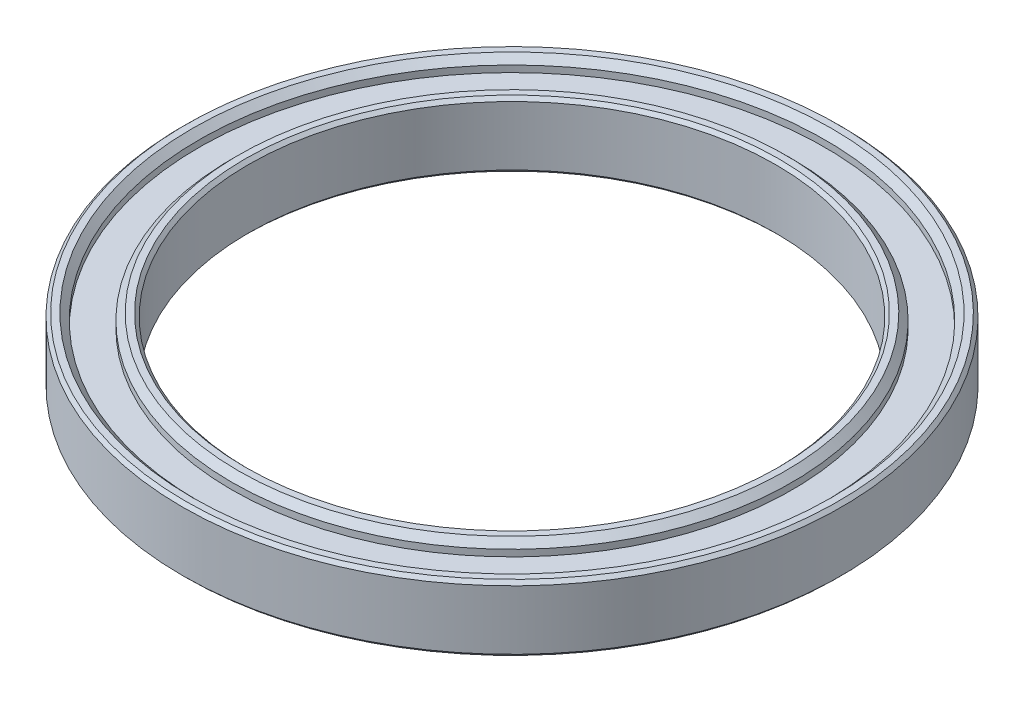
ISO-10303-21;
HEADER;
FILE_DESCRIPTION(('STEP AP214'),'2;1');
FILE_NAME('part.step','',(''),(''),'','','');
FILE_SCHEMA(('AUTOMOTIVE_DESIGN { 1 0 10303 214 1 1 1 1 }'));
ENDSEC;
DATA;
#1=APPLICATION_CONTEXT('core data for automotive mechanical design processes');
#2=APPLICATION_PROTOCOL_DEFINITION('international standard','automotive_design',2000,#1);
#3=PRODUCT_CONTEXT('',#1,'mechanical');
#4=PRODUCT('Part','Part','',(#3));
#5=PRODUCT_RELATED_PRODUCT_CATEGORY('part','',(#4));
#6=PRODUCT_DEFINITION_FORMATION('','',#4);
#7=PRODUCT_DEFINITION_CONTEXT('part definition',#1,'design');
#8=PRODUCT_DEFINITION('design','',#6,#7);
#9=PRODUCT_DEFINITION_SHAPE('','',#8);
#10=(LENGTH_UNIT() NAMED_UNIT(*) SI_UNIT(.MILLI.,.METRE.));
#11=(NAMED_UNIT(*) PLANE_ANGLE_UNIT() SI_UNIT($,.RADIAN.));
#12=(NAMED_UNIT(*) SI_UNIT($,.STERADIAN.) SOLID_ANGLE_UNIT());
#13=UNCERTAINTY_MEASURE_WITH_UNIT(LENGTH_MEASURE(1.E-05),#10,'distance_accuracy_value','');
#14=(GEOMETRIC_REPRESENTATION_CONTEXT(3) GLOBAL_UNCERTAINTY_ASSIGNED_CONTEXT((#13)) GLOBAL_UNIT_ASSIGNED_CONTEXT((#10,
#11,#12)) REPRESENTATION_CONTEXT('',''));
#15=CARTESIAN_POINT('',(0.,0.,0.));
#16=DIRECTION('',(0.,0.,1.));
#17=DIRECTION('',(1.,0.,0.));
#18=AXIS2_PLACEMENT_3D('',#15,#16,#17);
#19=CARTESIAN_POINT('',(0.,0.,0.));
#20=DIRECTION('',(0.,1.,0.));
#21=DIRECTION('',(0.,0.,1.));
#22=AXIS2_PLACEMENT_3D('',#19,#20,#21);
#23=PLANE('',#22);
#24=CARTESIAN_POINT('',(0.,0.,0.));
#25=DIRECTION('',(0.,1.,0.));
#26=DIRECTION('',(0.,0.,1.));
#27=AXIS2_PLACEMENT_3D('',#24,#25,#26);
#28=CIRCLE('',#27,41.5);
#29=CARTESIAN_POINT('',(0.,0.,41.5));
#30=VERTEX_POINT('',#29);
#31=EDGE_CURVE('E59',#30,#30,#28,.F.);
#32=ORIENTED_EDGE('',*,*,#31,.T.);
#33=EDGE_LOOP('',(#32));
#34=FACE_BOUND('',#33,.T.);
#35=CARTESIAN_POINT('',(0.,0.,0.));
#36=DIRECTION('',(0.,1.,0.));
#37=DIRECTION('',(0.,0.,1.));
#38=AXIS2_PLACEMENT_3D('',#35,#36,#37);
#39=CIRCLE('',#38,40.5);
#40=CARTESIAN_POINT('',(0.,0.,40.5));
#41=VERTEX_POINT('',#40);
#42=EDGE_CURVE('E94',#41,#41,#39,.T.);
#43=ORIENTED_EDGE('',*,*,#42,.T.);
#44=EDGE_LOOP('',(#43));
#45=FACE_BOUND('',#44,.T.);
#46=ADVANCED_FACE('F43',(#34,#45),#23,.F.);
#47=CARTESIAN_POINT('',(0.,10.,0.));
#48=DIRECTION('',(0.,1.,0.));
#49=DIRECTION('',(0.,0.,1.));
#50=AXIS2_PLACEMENT_3D('',#47,#48,#49);
#51=PLANE('',#50);
#52=CARTESIAN_POINT('',(0.,10.,0.));
#53=DIRECTION('',(0.,1.,0.));
#54=DIRECTION('',(0.,0.,1.));
#55=AXIS2_PLACEMENT_3D('',#52,#53,#54);
#56=CIRCLE('',#55,41.5);
#57=CARTESIAN_POINT('',(0.,10.,41.5));
#58=VERTEX_POINT('',#57);
#59=EDGE_CURVE('E67',#58,#58,#56,.T.);
#60=ORIENTED_EDGE('',*,*,#59,.T.);
#61=EDGE_LOOP('',(#60));
#62=FACE_BOUND('',#61,.T.);
#63=CARTESIAN_POINT('',(0.,10.,0.));
#64=DIRECTION('',(0.,1.,0.));
#65=DIRECTION('',(0.,0.,1.));
#66=AXIS2_PLACEMENT_3D('',#63,#64,#65);
#67=CIRCLE('',#66,40.5);
#68=CARTESIAN_POINT('',(0.,10.,40.5));
#69=VERTEX_POINT('',#68);
#70=EDGE_CURVE('E79',#69,#69,#67,.F.);
#71=ORIENTED_EDGE('',*,*,#70,.T.);
#72=EDGE_LOOP('',(#71));
#73=FACE_BOUND('',#72,.T.);
#74=ADVANCED_FACE('F133',(#62,#73),#51,.T.);
#75=CARTESIAN_POINT('',(0.,10.,0.));
#76=DIRECTION('',(0.,1.,0.));
#77=DIRECTION('',(0.,0.,1.));
#78=AXIS2_PLACEMENT_3D('',#75,#76,#77);
#79=CIRCLE('',#78,48.5);
#80=CARTESIAN_POINT('',(0.,10.,48.5));
#81=VERTEX_POINT('',#80);
#82=EDGE_CURVE('E70',#81,#81,#79,.F.);
#83=ORIENTED_EDGE('',*,*,#82,.T.);
#84=EDGE_LOOP('',(#83));
#85=FACE_BOUND('',#84,.T.);
#86=CARTESIAN_POINT('',(0.,10.,0.));
#87=DIRECTION('',(0.,1.,0.));
#88=DIRECTION('',(0.,0.,1.));
#89=AXIS2_PLACEMENT_3D('',#86,#87,#88);
#90=CIRCLE('',#89,49.5);
#91=CARTESIAN_POINT('',(0.,10.,49.5));
#92=VERTEX_POINT('',#91);
#93=EDGE_CURVE('E76',#92,#92,#90,.T.);
#94=ORIENTED_EDGE('',*,*,#93,.T.);
#95=EDGE_LOOP('',(#94));
#96=FACE_BOUND('',#95,.T.);
#97=ADVANCED_FACE('F140',(#85,#96),#51,.T.);
#98=CARTESIAN_POINT('',(0.,0.,0.));
#99=DIRECTION('',(0.,1.,0.));
#100=DIRECTION('',(0.,0.,1.));
#101=AXIS2_PLACEMENT_3D('',#98,#99,#100);
#102=CIRCLE('',#101,48.5);
#103=CARTESIAN_POINT('',(0.,0.,48.5));
#104=VERTEX_POINT('',#103);
#105=EDGE_CURVE('E10',#104,#104,#102,.T.);
#106=ORIENTED_EDGE('',*,*,#105,.T.);
#107=EDGE_LOOP('',(#106));
#108=FACE_BOUND('',#107,.T.);
#109=CARTESIAN_POINT('',(0.,0.,0.));
#110=DIRECTION('',(0.,1.,0.));
#111=DIRECTION('',(0.,0.,1.));
#112=AXIS2_PLACEMENT_3D('',#109,#110,#111);
#113=CIRCLE('',#112,49.5);
#114=CARTESIAN_POINT('',(0.,0.,49.5));
#115=VERTEX_POINT('',#114);
#116=EDGE_CURVE('E97',#115,#115,#113,.F.);
#117=ORIENTED_EDGE('',*,*,#116,.T.);
#118=EDGE_LOOP('',(#117));
#119=FACE_BOUND('',#118,.T.);
#120=ADVANCED_FACE('F136',(#108,#119),#23,.F.);
#121=CARTESIAN_POINT('',(0.,10.,0.));
#122=DIRECTION('',(0.,-1.,0.));
#123=DIRECTION('',(0.,0.,-1.));
#124=AXIS2_PLACEMENT_3D('',#121,#122,#123);
#125=CYLINDRICAL_SURFACE('',#124,50.);
#126=CARTESIAN_POINT('',(0.,0.499999999999994,0.));
#127=DIRECTION('',(0.,1.,0.));
#128=DIRECTION('',(0.,0.,1.));
#129=AXIS2_PLACEMENT_3D('',#126,#127,#128);
#130=CIRCLE('',#129,50.);
#131=CARTESIAN_POINT('',(0.,0.499999999999994,50.));
#132=VERTEX_POINT('',#131);
#133=EDGE_CURVE('E82',#132,#132,#130,.T.);
#134=ORIENTED_EDGE('',*,*,#133,.T.);
#135=EDGE_LOOP('',(#134));
#136=FACE_BOUND('',#135,.T.);
#137=CARTESIAN_POINT('',(0.,9.50000000000002,0.));
#138=DIRECTION('',(0.,1.,0.));
#139=DIRECTION('',(0.,0.,1.));
#140=AXIS2_PLACEMENT_3D('',#137,#138,#139);
#141=CIRCLE('',#140,50.);
#142=CARTESIAN_POINT('',(0.,9.50000000000002,50.));
#143=VERTEX_POINT('',#142);
#144=EDGE_CURVE('E85',#143,#143,#141,.F.);
#145=ORIENTED_EDGE('',*,*,#144,.T.);
#146=EDGE_LOOP('',(#145));
#147=FACE_BOUND('',#146,.T.);
#148=ADVANCED_FACE('F146',(#136,#147),#125,.T.);
#149=CARTESIAN_POINT('',(0.,10.,0.));
#150=DIRECTION('',(0.,-1.,0.));
#151=DIRECTION('',(0.,0.,-1.));
#152=AXIS2_PLACEMENT_3D('',#149,#150,#151);
#153=CYLINDRICAL_SURFACE('',#152,40.);
#154=CARTESIAN_POINT('',(0.,0.5,0.));
#155=DIRECTION('',(0.,1.,0.));
#156=DIRECTION('',(0.,0.,1.));
#157=AXIS2_PLACEMENT_3D('',#154,#155,#156);
#158=CIRCLE('',#157,40.);
#159=CARTESIAN_POINT('',(0.,0.5,40.));
#160=VERTEX_POINT('',#159);
#161=EDGE_CURVE('E88',#160,#160,#158,.F.);
#162=ORIENTED_EDGE('',*,*,#161,.T.);
#163=EDGE_LOOP('',(#162));
#164=FACE_BOUND('',#163,.T.);
#165=CARTESIAN_POINT('',(0.,9.49999999999996,0.));
#166=DIRECTION('',(0.,1.,0.));
#167=DIRECTION('',(0.,0.,1.));
#168=AXIS2_PLACEMENT_3D('',#165,#166,#167);
#169=CIRCLE('',#168,40.);
#170=CARTESIAN_POINT('',(0.,9.49999999999996,40.));
#171=VERTEX_POINT('',#170);
#172=EDGE_CURVE('E91',#171,#171,#169,.T.);
#173=ORIENTED_EDGE('',*,*,#172,.T.);
#174=EDGE_LOOP('',(#173));
#175=FACE_BOUND('',#174,.T.);
#176=ADVANCED_FACE('F151',(#164,#175),#153,.F.);
#177=CARTESIAN_POINT('',(0.,0.,0.));
#178=DIRECTION('',(0.,-1.,0.));
#179=DIRECTION('',(0.,0.,-1.));
#180=AXIS2_PLACEMENT_3D('',#177,#178,#179);
#181=CONICAL_SURFACE('',#180,40.5,0.785398163397448);
#182=ORIENTED_EDGE('',*,*,#161,.F.);
#183=EDGE_LOOP('',(#182));
#184=FACE_BOUND('',#183,.T.);
#185=ORIENTED_EDGE('',*,*,#42,.F.);
#186=EDGE_LOOP('',(#185));
#187=FACE_BOUND('',#186,.T.);
#188=ADVANCED_FACE('F161',(#184,#187),#181,.F.);
#189=CARTESIAN_POINT('',(0.,0.499999999999994,0.));
#190=DIRECTION('',(0.,1.,0.));
#191=DIRECTION('',(0.,0.,1.));
#192=AXIS2_PLACEMENT_3D('',#189,#190,#191);
#193=CONICAL_SURFACE('',#192,50.,0.785398163397448);
#194=ORIENTED_EDGE('',*,*,#116,.F.);
#195=EDGE_LOOP('',(#194));
#196=FACE_BOUND('',#195,.T.);
#197=ORIENTED_EDGE('',*,*,#133,.F.);
#198=EDGE_LOOP('',(#197));
#199=FACE_BOUND('',#198,.T.);
#200=ADVANCED_FACE('F157',(#196,#199),#193,.T.);
#201=CARTESIAN_POINT('',(0.,10.,0.));
#202=DIRECTION('',(0.,-1.,0.));
#203=DIRECTION('',(0.,0.,-1.));
#204=AXIS2_PLACEMENT_3D('',#201,#202,#203);
#205=CONICAL_SURFACE('',#204,49.5,0.785398163397469);
#206=ORIENTED_EDGE('',*,*,#144,.F.);
#207=EDGE_LOOP('',(#206));
#208=FACE_BOUND('',#207,.T.);
#209=ORIENTED_EDGE('',*,*,#93,.F.);
#210=EDGE_LOOP('',(#209));
#211=FACE_BOUND('',#210,.T.);
#212=ADVANCED_FACE('F160',(#208,#211),#205,.T.);
#213=CARTESIAN_POINT('',(0.,9.49999999999996,0.));
#214=DIRECTION('',(0.,1.,0.));
#215=DIRECTION('',(0.,0.,1.));
#216=AXIS2_PLACEMENT_3D('',#213,#214,#215);
#217=CONICAL_SURFACE('',#216,40.,0.785398163397434);
#218=ORIENTED_EDGE('',*,*,#70,.F.);
#219=EDGE_LOOP('',(#218));
#220=FACE_BOUND('',#219,.T.);
#221=ORIENTED_EDGE('',*,*,#172,.F.);
#222=EDGE_LOOP('',(#221));
#223=FACE_BOUND('',#222,.T.);
#224=ADVANCED_FACE('F169',(#220,#223),#217,.F.);
#225=CARTESIAN_POINT('',(0.,8.,0.));
#226=DIRECTION('',(0.,1.,0.));
#227=DIRECTION('',(0.,0.,1.));
#228=AXIS2_PLACEMENT_3D('',#225,#226,#227);
#229=CYLINDRICAL_SURFACE('',#228,47.5);
#230=CARTESIAN_POINT('',(0.,9.00000000000002,0.));
#231=DIRECTION('',(0.,1.,0.));
#232=DIRECTION('',(0.,0.,1.));
#233=AXIS2_PLACEMENT_3D('',#230,#231,#232);
#234=CIRCLE('',#233,47.5);
#235=CARTESIAN_POINT('',(0.,9.00000000000002,47.5));
#236=VERTEX_POINT('',#235);
#237=EDGE_CURVE('E73',#236,#236,#234,.T.);
#238=ORIENTED_EDGE('',*,*,#237,.T.);
#239=EDGE_LOOP('',(#238));
#240=FACE_BOUND('',#239,.T.);
#241=CARTESIAN_POINT('',(0.,8.,0.));
#242=DIRECTION('',(0.,1.,0.));
#243=DIRECTION('',(0.,0.,1.));
#244=AXIS2_PLACEMENT_3D('',#241,#242,#243);
#245=CIRCLE('',#244,47.5);
#246=CARTESIAN_POINT('',(0.,8.,47.5));
#247=VERTEX_POINT('',#246);
#248=EDGE_CURVE('E100',#247,#247,#245,.T.);
#249=ORIENTED_EDGE('',*,*,#248,.F.);
#250=EDGE_LOOP('',(#249));
#251=FACE_BOUND('',#250,.T.);
#252=ADVANCED_FACE('F176',(#240,#251),#229,.F.);
#253=CARTESIAN_POINT('',(0.,8.,0.));
#254=DIRECTION('',(0.,1.,0.));
#255=DIRECTION('',(0.,0.,1.));
#256=AXIS2_PLACEMENT_3D('',#253,#254,#255);
#257=PLANE('',#256);
#258=CARTESIAN_POINT('',(0.,8.,0.));
#259=DIRECTION('',(0.,1.,0.));
#260=DIRECTION('',(0.,0.,1.));
#261=AXIS2_PLACEMENT_3D('',#258,#259,#260);
#262=CIRCLE('',#261,42.5);
#263=CARTESIAN_POINT('',(0.,8.,42.5));
#264=VERTEX_POINT('',#263);
#265=EDGE_CURVE('E103',#264,#264,#262,.T.);
#266=ORIENTED_EDGE('',*,*,#265,.F.);
#267=EDGE_LOOP('',(#266));
#268=FACE_BOUND('',#267,.T.);
#269=ORIENTED_EDGE('',*,*,#248,.T.);
#270=EDGE_LOOP('',(#269));
#271=FACE_BOUND('',#270,.T.);
#272=ADVANCED_FACE('F264',(#268,#271),#257,.T.);
#273=CARTESIAN_POINT('',(0.,8.,0.));
#274=DIRECTION('',(0.,1.,0.));
#275=DIRECTION('',(0.,0.,1.));
#276=AXIS2_PLACEMENT_3D('',#273,#274,#275);
#277=CYLINDRICAL_SURFACE('',#276,42.5);
#278=CARTESIAN_POINT('',(0.,8.99999999999999,0.));
#279=DIRECTION('',(0.,1.,0.));
#280=DIRECTION('',(0.,0.,1.));
#281=AXIS2_PLACEMENT_3D('',#278,#279,#280);
#282=CIRCLE('',#281,42.5);
#283=CARTESIAN_POINT('',(0.,8.99999999999999,42.5));
#284=VERTEX_POINT('',#283);
#285=EDGE_CURVE('E64',#284,#284,#282,.F.);
#286=ORIENTED_EDGE('',*,*,#285,.T.);
#287=EDGE_LOOP('',(#286));
#288=FACE_BOUND('',#287,.T.);
#289=ORIENTED_EDGE('',*,*,#265,.T.);
#290=EDGE_LOOP('',(#289));
#291=FACE_BOUND('',#290,.T.);
#292=ADVANCED_FACE('F193',(#288,#291),#277,.T.);
#293=CARTESIAN_POINT('',(0.,9.00000000000002,0.));
#294=DIRECTION('',(0.,1.,0.));
#295=DIRECTION('',(0.,0.,1.));
#296=AXIS2_PLACEMENT_3D('',#293,#294,#295);
#297=CONICAL_SURFACE('',#296,47.5,0.785398163397441);
#298=ORIENTED_EDGE('',*,*,#82,.F.);
#299=EDGE_LOOP('',(#298));
#300=FACE_BOUND('',#299,.T.);
#301=ORIENTED_EDGE('',*,*,#237,.F.);
#302=EDGE_LOOP('',(#301));
#303=FACE_BOUND('',#302,.T.);
#304=ADVANCED_FACE('F128',(#300,#303),#297,.F.);
#305=CARTESIAN_POINT('',(0.,10.,0.));
#306=DIRECTION('',(0.,-1.,0.));
#307=DIRECTION('',(0.,0.,-1.));
#308=AXIS2_PLACEMENT_3D('',#305,#306,#307);
#309=CONICAL_SURFACE('',#308,41.5,0.785398163397438);
#310=ORIENTED_EDGE('',*,*,#285,.F.);
#311=EDGE_LOOP('',(#310));
#312=FACE_BOUND('',#311,.T.);
#313=ORIENTED_EDGE('',*,*,#59,.F.);
#314=EDGE_LOOP('',(#313));
#315=FACE_BOUND('',#314,.T.);
#316=ADVANCED_FACE('F123',(#312,#315),#309,.T.);
#317=CARTESIAN_POINT('',(0.,2.,0.));
#318=DIRECTION('',(0.,-1.,0.));
#319=DIRECTION('',(0.,0.,-1.));
#320=AXIS2_PLACEMENT_3D('',#317,#318,#319);
#321=CYLINDRICAL_SURFACE('',#320,47.5);
#322=CARTESIAN_POINT('',(0.,0.99999999999998,0.));
#323=DIRECTION('',(0.,1.,0.));
#324=DIRECTION('',(0.,0.,1.));
#325=AXIS2_PLACEMENT_3D('',#322,#323,#324);
#326=CIRCLE('',#325,47.5);
#327=CARTESIAN_POINT('',(0.,0.99999999999998,47.5));
#328=VERTEX_POINT('',#327);
#329=EDGE_CURVE('E51',#328,#328,#326,.F.);
#330=ORIENTED_EDGE('',*,*,#329,.T.);
#331=EDGE_LOOP('',(#330));
#332=FACE_BOUND('',#331,.T.);
#333=CARTESIAN_POINT('',(0.,2.,0.));
#334=DIRECTION('',(0.,-1.,0.));
#335=DIRECTION('',(0.,0.,-1.));
#336=AXIS2_PLACEMENT_3D('',#333,#334,#335);
#337=CIRCLE('',#336,47.5);
#338=CARTESIAN_POINT('',(0.,2.,-47.5));
#339=VERTEX_POINT('',#338);
#340=EDGE_CURVE('E106',#339,#339,#337,.T.);
#341=ORIENTED_EDGE('',*,*,#340,.F.);
#342=EDGE_LOOP('',(#341));
#343=FACE_BOUND('',#342,.T.);
#344=ADVANCED_FACE('F118',(#332,#343),#321,.F.);
#345=CARTESIAN_POINT('',(0.,2.,0.));
#346=DIRECTION('',(0.,-1.,0.));
#347=DIRECTION('',(0.,0.,-1.));
#348=AXIS2_PLACEMENT_3D('',#345,#346,#347);
#349=PLANE('',#348);
#350=CARTESIAN_POINT('',(0.,2.,0.));
#351=DIRECTION('',(0.,-1.,0.));
#352=DIRECTION('',(0.,0.,-1.));
#353=AXIS2_PLACEMENT_3D('',#350,#351,#352);
#354=CIRCLE('',#353,42.5);
#355=CARTESIAN_POINT('',(0.,2.,-42.5));
#356=VERTEX_POINT('',#355);
#357=EDGE_CURVE('E109',#356,#356,#354,.T.);
#358=ORIENTED_EDGE('',*,*,#357,.F.);
#359=EDGE_LOOP('',(#358));
#360=FACE_BOUND('',#359,.T.);
#361=ORIENTED_EDGE('',*,*,#340,.T.);
#362=EDGE_LOOP('',(#361));
#363=FACE_BOUND('',#362,.T.);
#364=ADVANCED_FACE('F115',(#360,#363),#349,.T.);
#365=CARTESIAN_POINT('',(0.,2.,0.));
#366=DIRECTION('',(0.,-1.,0.));
#367=DIRECTION('',(0.,0.,-1.));
#368=AXIS2_PLACEMENT_3D('',#365,#366,#367);
#369=CYLINDRICAL_SURFACE('',#368,42.5);
#370=CARTESIAN_POINT('',(0.,1.00000000000002,0.));
#371=DIRECTION('',(0.,1.,0.));
#372=DIRECTION('',(0.,0.,1.));
#373=AXIS2_PLACEMENT_3D('',#370,#371,#372);
#374=CIRCLE('',#373,42.5);
#375=CARTESIAN_POINT('',(0.,1.00000000000002,42.5));
#376=VERTEX_POINT('',#375);
#377=EDGE_CURVE('E55',#376,#376,#374,.T.);
#378=ORIENTED_EDGE('',*,*,#377,.T.);
#379=EDGE_LOOP('',(#378));
#380=FACE_BOUND('',#379,.T.);
#381=ORIENTED_EDGE('',*,*,#357,.T.);
#382=EDGE_LOOP('',(#381));
#383=FACE_BOUND('',#382,.T.);
#384=ADVANCED_FACE('F113',(#380,#383),#369,.T.);
#385=CARTESIAN_POINT('',(0.,0.,0.));
#386=DIRECTION('',(0.,1.,0.));
#387=DIRECTION('',(0.,0.,1.));
#388=AXIS2_PLACEMENT_3D('',#385,#386,#387);
#389=CONICAL_SURFACE('',#388,41.5,0.785398163397445);
#390=ORIENTED_EDGE('',*,*,#377,.F.);
#391=EDGE_LOOP('',(#390));
#392=FACE_BOUND('',#391,.T.);
#393=ORIENTED_EDGE('',*,*,#31,.F.);
#394=EDGE_LOOP('',(#393));
#395=FACE_BOUND('',#394,.T.);
#396=ADVANCED_FACE('F198',(#392,#395),#389,.T.);
#397=CARTESIAN_POINT('',(0.,0.99999999999998,0.));
#398=DIRECTION('',(0.,-1.,0.));
#399=DIRECTION('',(0.,0.,-1.));
#400=AXIS2_PLACEMENT_3D('',#397,#398,#399);
#401=CONICAL_SURFACE('',#400,47.5,0.785398163397441);
#402=ORIENTED_EDGE('',*,*,#105,.F.);
#403=EDGE_LOOP('',(#402));
#404=FACE_BOUND('',#403,.T.);
#405=ORIENTED_EDGE('',*,*,#329,.F.);
#406=EDGE_LOOP('',(#405));
#407=FACE_BOUND('',#406,.T.);
#408=ADVANCED_FACE('F46',(#404,#407),#401,.F.);
#409=CLOSED_SHELL('',(#46,#74,#97,#120,#148,#176,#188,#200,#212,#224,#252,#272,#292,#304,#316,
#344,#364,#384,#396,#408));
#410=MANIFOLD_SOLID_BREP('B2',#409);
#411=ADVANCED_BREP_SHAPE_REPRESENTATION('',(#18,#410),#14);
#412=SHAPE_DEFINITION_REPRESENTATION(#9,#411);
ENDSEC;
END-ISO-10303-21;
